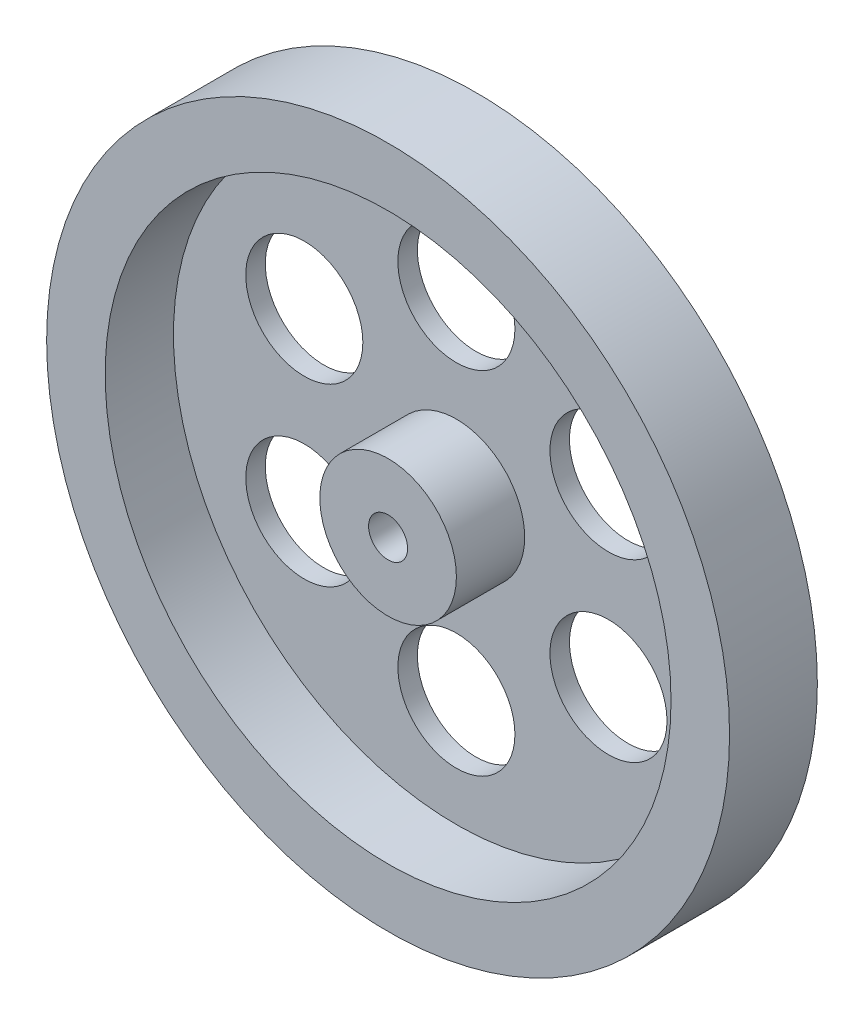
ISO-10303-21;
HEADER;
FILE_DESCRIPTION(('STEP AP214'),'2;1');
FILE_NAME('part.step','',(''),(''),'','','');
FILE_SCHEMA(('AUTOMOTIVE_DESIGN { 1 0 10303 214 1 1 1 1 }'));
ENDSEC;
DATA;
#1=APPLICATION_CONTEXT('core data for automotive mechanical design processes');
#2=APPLICATION_PROTOCOL_DEFINITION('international standard','automotive_design',2000,#1);
#3=PRODUCT_CONTEXT('',#1,'mechanical');
#4=PRODUCT('Part','Part','',(#3));
#5=PRODUCT_RELATED_PRODUCT_CATEGORY('part','',(#4));
#6=PRODUCT_DEFINITION_FORMATION('','',#4);
#7=PRODUCT_DEFINITION_CONTEXT('part definition',#1,'design');
#8=PRODUCT_DEFINITION('design','',#6,#7);
#9=PRODUCT_DEFINITION_SHAPE('','',#8);
#10=(LENGTH_UNIT() NAMED_UNIT(*) SI_UNIT(.MILLI.,.METRE.));
#11=(NAMED_UNIT(*) PLANE_ANGLE_UNIT() SI_UNIT($,.RADIAN.));
#12=(NAMED_UNIT(*) SI_UNIT($,.STERADIAN.) SOLID_ANGLE_UNIT());
#13=UNCERTAINTY_MEASURE_WITH_UNIT(LENGTH_MEASURE(1.E-05),#10,'distance_accuracy_value','');
#14=(GEOMETRIC_REPRESENTATION_CONTEXT(3) GLOBAL_UNCERTAINTY_ASSIGNED_CONTEXT((#13)) GLOBAL_UNIT_ASSIGNED_CONTEXT((#10,
#11,#12)) REPRESENTATION_CONTEXT('',''));
#15=CARTESIAN_POINT('',(0.,0.,0.));
#16=DIRECTION('',(0.,0.,1.));
#17=DIRECTION('',(1.,0.,0.));
#18=AXIS2_PLACEMENT_3D('',#15,#16,#17);
#19=CARTESIAN_POINT('',(0.,0.,9.));
#20=DIRECTION('',(0.,0.,1.));
#21=DIRECTION('',(1.,0.,0.));
#22=AXIS2_PLACEMENT_3D('',#19,#20,#21);
#23=PLANE('',#22);
#24=CARTESIAN_POINT('',(0.,0.,9.));
#25=DIRECTION('',(0.,0.,1.));
#26=DIRECTION('',(1.,0.,0.));
#27=AXIS2_PLACEMENT_3D('',#24,#25,#26);
#28=CIRCLE('',#27,2.);
#29=CARTESIAN_POINT('',(2.,0.,9.));
#30=VERTEX_POINT('',#29);
#31=EDGE_CURVE('E44',#30,#30,#28,.T.);
#32=ORIENTED_EDGE('',*,*,#31,.F.);
#33=EDGE_LOOP('',(#32));
#34=FACE_BOUND('',#33,.T.);
#35=CARTESIAN_POINT('',(0.,0.,9.));
#36=DIRECTION('',(0.,0.,1.));
#37=DIRECTION('',(1.,0.,0.));
#38=AXIS2_PLACEMENT_3D('',#35,#36,#37);
#39=CIRCLE('',#38,7.);
#40=CARTESIAN_POINT('',(7.,0.,9.));
#41=VERTEX_POINT('',#40);
#42=EDGE_CURVE('E58',#41,#41,#39,.T.);
#43=ORIENTED_EDGE('',*,*,#42,.T.);
#44=EDGE_LOOP('',(#43));
#45=FACE_BOUND('',#44,.T.);
#46=ADVANCED_FACE('F33',(#34,#45),#23,.T.);
#47=CARTESIAN_POINT('',(0.,0.,9.));
#48=DIRECTION('',(0.,0.,-1.));
#49=DIRECTION('',(-1.,0.,0.));
#50=AXIS2_PLACEMENT_3D('',#47,#48,#49);
#51=CYLINDRICAL_SURFACE('',#50,35.);
#52=CARTESIAN_POINT('',(0.,0.,9.));
#53=DIRECTION('',(0.,0.,1.));
#54=DIRECTION('',(1.,0.,0.));
#55=AXIS2_PLACEMENT_3D('',#52,#53,#54);
#56=CIRCLE('',#55,35.);
#57=CARTESIAN_POINT('',(35.,0.,9.));
#58=VERTEX_POINT('',#57);
#59=EDGE_CURVE('E10',#58,#58,#56,.T.);
#60=ORIENTED_EDGE('',*,*,#59,.F.);
#61=EDGE_LOOP('',(#60));
#62=FACE_BOUND('',#61,.T.);
#63=CARTESIAN_POINT('',(0.,0.,0.));
#64=DIRECTION('',(0.,0.,1.));
#65=DIRECTION('',(1.,0.,0.));
#66=AXIS2_PLACEMENT_3D('',#63,#64,#65);
#67=CIRCLE('',#66,35.);
#68=CARTESIAN_POINT('',(35.,0.,0.));
#69=VERTEX_POINT('',#68);
#70=EDGE_CURVE('E37',#69,#69,#67,.T.);
#71=ORIENTED_EDGE('',*,*,#70,.T.);
#72=EDGE_LOOP('',(#71));
#73=FACE_BOUND('',#72,.T.);
#74=ADVANCED_FACE('F35',(#62,#73),#51,.T.);
#75=CARTESIAN_POINT('',(0.,0.,9.));
#76=DIRECTION('',(0.,0.,1.));
#77=DIRECTION('',(1.,0.,0.));
#78=AXIS2_PLACEMENT_3D('',#75,#76,#77);
#79=CIRCLE('',#78,29.);
#80=CARTESIAN_POINT('',(29.,0.,9.));
#81=VERTEX_POINT('',#80);
#82=EDGE_CURVE('E52',#81,#81,#79,.T.);
#83=ORIENTED_EDGE('',*,*,#82,.F.);
#84=EDGE_LOOP('',(#83));
#85=FACE_BOUND('',#84,.T.);
#86=ORIENTED_EDGE('',*,*,#59,.T.);
#87=EDGE_LOOP('',(#86));
#88=FACE_BOUND('',#87,.T.);
#89=ADVANCED_FACE('F130',(#85,#88),#23,.T.);
#90=CARTESIAN_POINT('',(0.,0.,0.));
#91=DIRECTION('',(0.,0.,1.));
#92=DIRECTION('',(1.,0.,0.));
#93=AXIS2_PLACEMENT_3D('',#90,#91,#92);
#94=PLANE('',#93);
#95=CARTESIAN_POINT('',(15.5884572681201,9.00000000000044,0.));
#96=DIRECTION('',(0.,0.,1.));
#97=DIRECTION('',(1.,0.,0.));
#98=AXIS2_PLACEMENT_3D('',#95,#96,#97);
#99=CIRCLE('',#98,6.00000000000016);
#100=CARTESIAN_POINT('',(21.5884572681203,9.00000000000044,0.));
#101=VERTEX_POINT('',#100);
#102=EDGE_CURVE('E67',#101,#101,#99,.T.);
#103=ORIENTED_EDGE('',*,*,#102,.T.);
#104=EDGE_LOOP('',(#103));
#105=FACE_BOUND('',#104,.T.);
#106=CARTESIAN_POINT('',(15.5884572681207,-8.99999999999956,0.));
#107=DIRECTION('',(0.,0.,1.));
#108=DIRECTION('',(1.,0.,0.));
#109=AXIS2_PLACEMENT_3D('',#106,#107,#108);
#110=CIRCLE('',#109,6.00000000000069);
#111=CARTESIAN_POINT('',(21.5884572681213,-8.99999999999956,0.));
#112=VERTEX_POINT('',#111);
#113=EDGE_CURVE('E86',#112,#112,#110,.T.);
#114=ORIENTED_EDGE('',*,*,#113,.T.);
#115=EDGE_LOOP('',(#114));
#116=FACE_BOUND('',#115,.T.);
#117=CARTESIAN_POINT('',(1.01656844677915E-12,-18.,0.));
#118=DIRECTION('',(0.,0.,1.));
#119=DIRECTION('',(1.,0.,0.));
#120=AXIS2_PLACEMENT_3D('',#117,#118,#119);
#121=CIRCLE('',#120,6.00000000000109);
#122=CARTESIAN_POINT('',(6.00000000000211,-18.,0.));
#123=VERTEX_POINT('',#122);
#124=EDGE_CURVE('E80',#123,#123,#121,.T.);
#125=ORIENTED_EDGE('',*,*,#124,.T.);
#126=EDGE_LOOP('',(#125));
#127=FACE_BOUND('',#126,.T.);
#128=CARTESIAN_POINT('',(-15.5884572681191,-9.00000000000045,0.));
#129=DIRECTION('',(0.,0.,1.));
#130=DIRECTION('',(1.,0.,0.));
#131=AXIS2_PLACEMENT_3D('',#128,#129,#130);
#132=CIRCLE('',#131,6.00000000000103);
#133=CARTESIAN_POINT('',(-9.5884572681181,-9.00000000000045,0.));
#134=VERTEX_POINT('',#133);
#135=EDGE_CURVE('E73',#134,#134,#132,.T.);
#136=ORIENTED_EDGE('',*,*,#135,.T.);
#137=EDGE_LOOP('',(#136));
#138=FACE_BOUND('',#137,.T.);
#139=CARTESIAN_POINT('',(-15.5884572681196,8.99999999999955,0.));
#140=DIRECTION('',(0.,0.,1.));
#141=DIRECTION('',(1.,0.,0.));
#142=AXIS2_PLACEMENT_3D('',#139,#140,#141);
#143=CIRCLE('',#142,6.00000000000059);
#144=CARTESIAN_POINT('',(-9.58845726811906,8.99999999999955,0.));
#145=VERTEX_POINT('',#144);
#146=EDGE_CURVE('E74',#145,#145,#143,.T.);
#147=ORIENTED_EDGE('',*,*,#146,.T.);
#148=EDGE_LOOP('',(#147));
#149=FACE_BOUND('',#148,.T.);
#150=CARTESIAN_POINT('',(0.,18.,0.));
#151=DIRECTION('',(0.,0.,1.));
#152=DIRECTION('',(1.,0.,0.));
#153=AXIS2_PLACEMENT_3D('',#150,#151,#152);
#154=CIRCLE('',#153,6.);
#155=CARTESIAN_POINT('',(6.,18.,0.));
#156=VERTEX_POINT('',#155);
#157=EDGE_CURVE('E61',#156,#156,#154,.T.);
#158=ORIENTED_EDGE('',*,*,#157,.T.);
#159=EDGE_LOOP('',(#158));
#160=FACE_BOUND('',#159,.T.);
#161=CARTESIAN_POINT('',(0.,0.,0.));
#162=DIRECTION('',(0.,0.,1.));
#163=DIRECTION('',(1.,0.,0.));
#164=AXIS2_PLACEMENT_3D('',#161,#162,#163);
#165=CIRCLE('',#164,2.);
#166=CARTESIAN_POINT('',(2.,0.,0.));
#167=VERTEX_POINT('',#166);
#168=EDGE_CURVE('E48',#167,#167,#165,.T.);
#169=ORIENTED_EDGE('',*,*,#168,.T.);
#170=EDGE_LOOP('',(#169));
#171=FACE_BOUND('',#170,.T.);
#172=ORIENTED_EDGE('',*,*,#70,.F.);
#173=EDGE_LOOP('',(#172));
#174=FACE_BOUND('',#173,.T.);
#175=ADVANCED_FACE('F100',(#105,#116,#127,#138,#149,#160,#171,#174),#94,.F.);
#176=CARTESIAN_POINT('',(0.,0.,0.));
#177=DIRECTION('',(0.,0.,1.));
#178=DIRECTION('',(1.,0.,0.));
#179=AXIS2_PLACEMENT_3D('',#176,#177,#178);
#180=CYLINDRICAL_SURFACE('',#179,2.);
#181=ORIENTED_EDGE('',*,*,#31,.T.);
#182=EDGE_LOOP('',(#181));
#183=FACE_BOUND('',#182,.T.);
#184=ORIENTED_EDGE('',*,*,#168,.F.);
#185=EDGE_LOOP('',(#184));
#186=FACE_BOUND('',#185,.T.);
#187=ADVANCED_FACE('F126',(#183,#186),#180,.F.);
#188=CARTESIAN_POINT('',(0.,0.,2.));
#189=DIRECTION('',(0.,0.,1.));
#190=DIRECTION('',(1.,0.,0.));
#191=AXIS2_PLACEMENT_3D('',#188,#189,#190);
#192=CYLINDRICAL_SURFACE('',#191,29.);
#193=CARTESIAN_POINT('',(0.,0.,2.));
#194=DIRECTION('',(0.,0.,1.));
#195=DIRECTION('',(1.,0.,0.));
#196=AXIS2_PLACEMENT_3D('',#193,#194,#195);
#197=CIRCLE('',#196,29.);
#198=CARTESIAN_POINT('',(29.,0.,2.));
#199=VERTEX_POINT('',#198);
#200=EDGE_CURVE('E51',#199,#199,#197,.T.);
#201=ORIENTED_EDGE('',*,*,#200,.F.);
#202=EDGE_LOOP('',(#201));
#203=FACE_BOUND('',#202,.T.);
#204=ORIENTED_EDGE('',*,*,#82,.T.);
#205=EDGE_LOOP('',(#204));
#206=FACE_BOUND('',#205,.T.);
#207=ADVANCED_FACE('F115',(#203,#206),#192,.F.);
#208=CARTESIAN_POINT('',(0.,0.,2.));
#209=DIRECTION('',(0.,0.,1.));
#210=DIRECTION('',(1.,0.,0.));
#211=AXIS2_PLACEMENT_3D('',#208,#209,#210);
#212=PLANE('',#211);
#213=CARTESIAN_POINT('',(-15.5884572681191,-9.00000000000045,2.));
#214=DIRECTION('',(0.,0.,1.));
#215=DIRECTION('',(1.,0.,0.));
#216=AXIS2_PLACEMENT_3D('',#213,#214,#215);
#217=CIRCLE('',#216,6.00000000000103);
#218=CARTESIAN_POINT('',(-9.5884572681181,-9.00000000000045,2.));
#219=VERTEX_POINT('',#218);
#220=EDGE_CURVE('E70',#219,#219,#217,.T.);
#221=ORIENTED_EDGE('',*,*,#220,.F.);
#222=EDGE_LOOP('',(#221));
#223=FACE_BOUND('',#222,.T.);
#224=CARTESIAN_POINT('',(15.5884572681201,9.00000000000044,2.));
#225=DIRECTION('',(0.,0.,1.));
#226=DIRECTION('',(1.,0.,0.));
#227=AXIS2_PLACEMENT_3D('',#224,#225,#226);
#228=CIRCLE('',#227,6.00000000000016);
#229=CARTESIAN_POINT('',(21.5884572681203,9.00000000000044,2.));
#230=VERTEX_POINT('',#229);
#231=EDGE_CURVE('E89',#230,#230,#228,.T.);
#232=ORIENTED_EDGE('',*,*,#231,.F.);
#233=EDGE_LOOP('',(#232));
#234=FACE_BOUND('',#233,.T.);
#235=CARTESIAN_POINT('',(15.5884572681207,-8.99999999999956,2.));
#236=DIRECTION('',(0.,0.,1.));
#237=DIRECTION('',(1.,0.,0.));
#238=AXIS2_PLACEMENT_3D('',#235,#236,#237);
#239=CIRCLE('',#238,6.00000000000069);
#240=CARTESIAN_POINT('',(21.5884572681213,-8.99999999999956,2.));
#241=VERTEX_POINT('',#240);
#242=EDGE_CURVE('E83',#241,#241,#239,.T.);
#243=ORIENTED_EDGE('',*,*,#242,.F.);
#244=EDGE_LOOP('',(#243));
#245=FACE_BOUND('',#244,.T.);
#246=CARTESIAN_POINT('',(1.01656844677915E-12,-18.,2.));
#247=DIRECTION('',(0.,0.,1.));
#248=DIRECTION('',(1.,0.,0.));
#249=AXIS2_PLACEMENT_3D('',#246,#247,#248);
#250=CIRCLE('',#249,6.00000000000109);
#251=CARTESIAN_POINT('',(6.00000000000211,-18.,2.));
#252=VERTEX_POINT('',#251);
#253=EDGE_CURVE('E77',#252,#252,#250,.T.);
#254=ORIENTED_EDGE('',*,*,#253,.F.);
#255=EDGE_LOOP('',(#254));
#256=FACE_BOUND('',#255,.T.);
#257=CARTESIAN_POINT('',(-15.5884572681196,8.99999999999955,2.));
#258=DIRECTION('',(0.,0.,1.));
#259=DIRECTION('',(1.,0.,0.));
#260=AXIS2_PLACEMENT_3D('',#257,#258,#259);
#261=CIRCLE('',#260,6.00000000000059);
#262=CARTESIAN_POINT('',(-9.58845726811906,8.99999999999955,2.));
#263=VERTEX_POINT('',#262);
#264=EDGE_CURVE('E94',#263,#263,#261,.T.);
#265=ORIENTED_EDGE('',*,*,#264,.F.);
#266=EDGE_LOOP('',(#265));
#267=FACE_BOUND('',#266,.T.);
#268=CARTESIAN_POINT('',(0.,18.,2.));
#269=DIRECTION('',(0.,0.,1.));
#270=DIRECTION('',(1.,0.,0.));
#271=AXIS2_PLACEMENT_3D('',#268,#269,#270);
#272=CIRCLE('',#271,6.);
#273=CARTESIAN_POINT('',(6.,18.,2.));
#274=VERTEX_POINT('',#273);
#275=EDGE_CURVE('E64',#274,#274,#272,.T.);
#276=ORIENTED_EDGE('',*,*,#275,.F.);
#277=EDGE_LOOP('',(#276));
#278=FACE_BOUND('',#277,.T.);
#279=CARTESIAN_POINT('',(0.,0.,2.));
#280=DIRECTION('',(0.,0.,1.));
#281=DIRECTION('',(1.,0.,0.));
#282=AXIS2_PLACEMENT_3D('',#279,#280,#281);
#283=CIRCLE('',#282,7.);
#284=CARTESIAN_POINT('',(7.,0.,2.));
#285=VERTEX_POINT('',#284);
#286=EDGE_CURVE('E55',#285,#285,#283,.T.);
#287=ORIENTED_EDGE('',*,*,#286,.F.);
#288=EDGE_LOOP('',(#287));
#289=FACE_BOUND('',#288,.T.);
#290=ORIENTED_EDGE('',*,*,#200,.T.);
#291=EDGE_LOOP('',(#290));
#292=FACE_BOUND('',#291,.T.);
#293=ADVANCED_FACE('F111',(#223,#234,#245,#256,#267,#278,#289,#292),#212,.T.);
#294=CARTESIAN_POINT('',(0.,0.,2.));
#295=DIRECTION('',(0.,0.,1.));
#296=DIRECTION('',(1.,0.,0.));
#297=AXIS2_PLACEMENT_3D('',#294,#295,#296);
#298=CYLINDRICAL_SURFACE('',#297,7.);
#299=ORIENTED_EDGE('',*,*,#286,.T.);
#300=EDGE_LOOP('',(#299));
#301=FACE_BOUND('',#300,.T.);
#302=ORIENTED_EDGE('',*,*,#42,.F.);
#303=EDGE_LOOP('',(#302));
#304=FACE_BOUND('',#303,.T.);
#305=ADVANCED_FACE('F114',(#301,#304),#298,.T.);
#306=CARTESIAN_POINT('',(0.,18.,0.));
#307=DIRECTION('',(0.,0.,1.));
#308=DIRECTION('',(1.,0.,0.));
#309=AXIS2_PLACEMENT_3D('',#306,#307,#308);
#310=CYLINDRICAL_SURFACE('',#309,6.);
#311=ORIENTED_EDGE('',*,*,#157,.F.);
#312=EDGE_LOOP('',(#311));
#313=FACE_BOUND('',#312,.T.);
#314=ORIENTED_EDGE('',*,*,#275,.T.);
#315=EDGE_LOOP('',(#314));
#316=FACE_BOUND('',#315,.T.);
#317=ADVANCED_FACE('F107',(#313,#316),#310,.F.);
#318=CARTESIAN_POINT('',(-15.5884572681196,8.99999999999955,0.));
#319=DIRECTION('',(0.,0.,1.));
#320=DIRECTION('',(1.,0.,0.));
#321=AXIS2_PLACEMENT_3D('',#318,#319,#320);
#322=CYLINDRICAL_SURFACE('',#321,6.00000000000059);
#323=ORIENTED_EDGE('',*,*,#146,.F.);
#324=EDGE_LOOP('',(#323));
#325=FACE_BOUND('',#324,.T.);
#326=ORIENTED_EDGE('',*,*,#264,.T.);
#327=EDGE_LOOP('',(#326));
#328=FACE_BOUND('',#327,.T.);
#329=ADVANCED_FACE('F103',(#325,#328),#322,.F.);
#330=CARTESIAN_POINT('',(1.01656844677915E-12,-18.,0.));
#331=DIRECTION('',(0.,0.,1.));
#332=DIRECTION('',(1.,0.,0.));
#333=AXIS2_PLACEMENT_3D('',#330,#331,#332);
#334=CYLINDRICAL_SURFACE('',#333,6.00000000000109);
#335=ORIENTED_EDGE('',*,*,#124,.F.);
#336=EDGE_LOOP('',(#335));
#337=FACE_BOUND('',#336,.T.);
#338=ORIENTED_EDGE('',*,*,#253,.T.);
#339=EDGE_LOOP('',(#338));
#340=FACE_BOUND('',#339,.T.);
#341=ADVANCED_FACE('F106',(#337,#340),#334,.F.);
#342=CARTESIAN_POINT('',(15.5884572681207,-8.99999999999956,0.));
#343=DIRECTION('',(0.,0.,1.));
#344=DIRECTION('',(1.,0.,0.));
#345=AXIS2_PLACEMENT_3D('',#342,#343,#344);
#346=CYLINDRICAL_SURFACE('',#345,6.00000000000069);
#347=ORIENTED_EDGE('',*,*,#113,.F.);
#348=EDGE_LOOP('',(#347));
#349=FACE_BOUND('',#348,.T.);
#350=ORIENTED_EDGE('',*,*,#242,.T.);
#351=EDGE_LOOP('',(#350));
#352=FACE_BOUND('',#351,.T.);
#353=ADVANCED_FACE('F206',(#349,#352),#346,.F.);
#354=CARTESIAN_POINT('',(15.5884572681201,9.00000000000044,0.));
#355=DIRECTION('',(0.,0.,1.));
#356=DIRECTION('',(1.,0.,0.));
#357=AXIS2_PLACEMENT_3D('',#354,#355,#356);
#358=CYLINDRICAL_SURFACE('',#357,6.00000000000016);
#359=ORIENTED_EDGE('',*,*,#102,.F.);
#360=EDGE_LOOP('',(#359));
#361=FACE_BOUND('',#360,.T.);
#362=ORIENTED_EDGE('',*,*,#231,.T.);
#363=EDGE_LOOP('',(#362));
#364=FACE_BOUND('',#363,.T.);
#365=ADVANCED_FACE('F216',(#361,#364),#358,.F.);
#366=CARTESIAN_POINT('',(-15.5884572681191,-9.00000000000045,0.));
#367=DIRECTION('',(0.,0.,1.));
#368=DIRECTION('',(1.,0.,0.));
#369=AXIS2_PLACEMENT_3D('',#366,#367,#368);
#370=CYLINDRICAL_SURFACE('',#369,6.00000000000103);
#371=ORIENTED_EDGE('',*,*,#135,.F.);
#372=EDGE_LOOP('',(#371));
#373=FACE_BOUND('',#372,.T.);
#374=ORIENTED_EDGE('',*,*,#220,.T.);
#375=EDGE_LOOP('',(#374));
#376=FACE_BOUND('',#375,.T.);
#377=ADVANCED_FACE('F226',(#373,#376),#370,.F.);
#378=CLOSED_SHELL('',(#46,#74,#89,#175,#187,#207,#293,#305,#317,#329,#341,#353,#365,#377));
#379=MANIFOLD_SOLID_BREP('B2',#378);
#380=ADVANCED_BREP_SHAPE_REPRESENTATION('',(#18,#379),#14);
#381=SHAPE_DEFINITION_REPRESENTATION(#9,#380);
ENDSEC;
END-ISO-10303-21;
